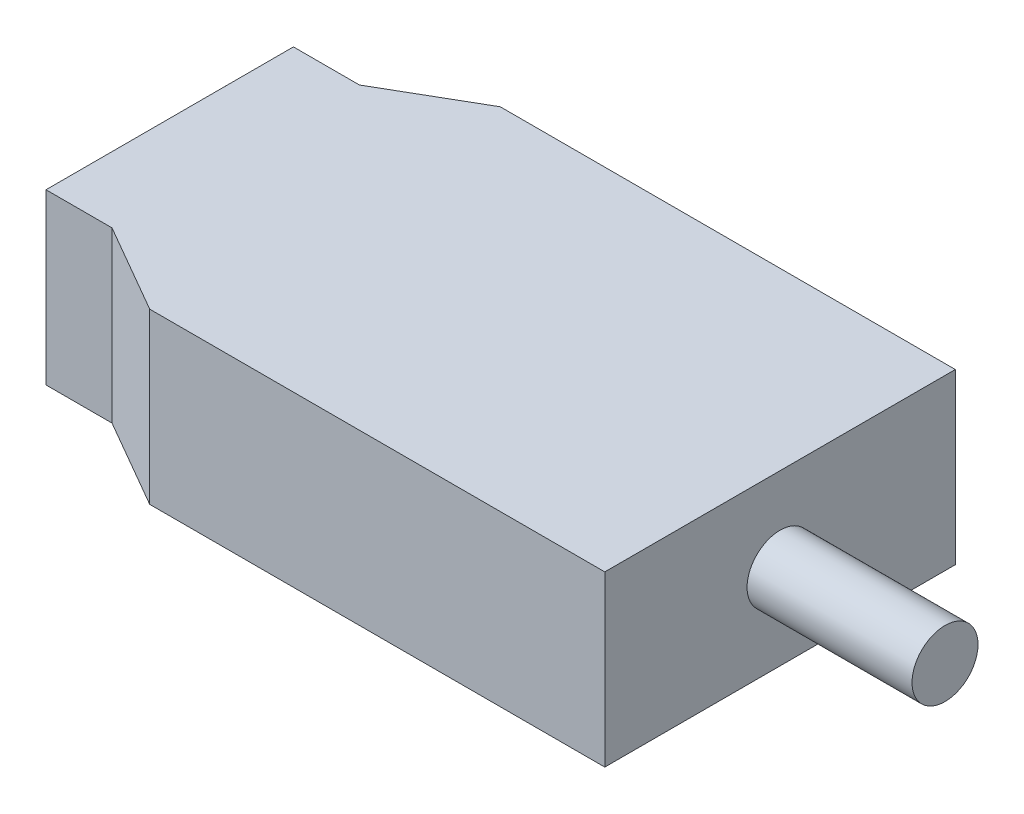
ISO-10303-21;
HEADER;
FILE_DESCRIPTION(('STEP AP214'),'2;1');
FILE_NAME('part.step','',(''),(''),'','','');
FILE_SCHEMA(('AUTOMOTIVE_DESIGN { 1 0 10303 214 1 1 1 1 }'));
ENDSEC;
DATA;
#1=APPLICATION_CONTEXT('core data for automotive mechanical design processes');
#2=APPLICATION_PROTOCOL_DEFINITION('international standard','automotive_design',2000,#1);
#3=PRODUCT_CONTEXT('',#1,'mechanical');
#4=PRODUCT('Part','Part','',(#3));
#5=PRODUCT_RELATED_PRODUCT_CATEGORY('part','',(#4));
#6=PRODUCT_DEFINITION_FORMATION('','',#4);
#7=PRODUCT_DEFINITION_CONTEXT('part definition',#1,'design');
#8=PRODUCT_DEFINITION('design','',#6,#7);
#9=PRODUCT_DEFINITION_SHAPE('','',#8);
#10=(LENGTH_UNIT() NAMED_UNIT(*) SI_UNIT(.MILLI.,.METRE.));
#11=(NAMED_UNIT(*) PLANE_ANGLE_UNIT() SI_UNIT($,.RADIAN.));
#12=(NAMED_UNIT(*) SI_UNIT($,.STERADIAN.) SOLID_ANGLE_UNIT());
#13=UNCERTAINTY_MEASURE_WITH_UNIT(LENGTH_MEASURE(1.E-05),#10,'distance_accuracy_value','');
#14=(GEOMETRIC_REPRESENTATION_CONTEXT(3) GLOBAL_UNCERTAINTY_ASSIGNED_CONTEXT((#13)) GLOBAL_UNIT_ASSIGNED_CONTEXT((#10,
#11,#12)) REPRESENTATION_CONTEXT('',''));
#15=CARTESIAN_POINT('',(0.,0.,0.));
#16=DIRECTION('',(0.,0.,1.));
#17=DIRECTION('',(1.,0.,0.));
#18=AXIS2_PLACEMENT_3D('',#15,#16,#17);
#19=CARTESIAN_POINT('',(0.,-10.25,-21.25));
#20=DIRECTION('',(1.,0.,0.));
#21=DIRECTION('',(0.,0.,-1.));
#22=AXIS2_PLACEMENT_3D('',#19,#20,#21);
#23=PLANE('',#22);
#24=DIRECTION('',(0.,1.,0.));
#25=VECTOR('',#24,1.);
#26=CARTESIAN_POINT('',(0.,-10.25,-21.25));
#27=LINE('',#26,#25);
#28=CARTESIAN_POINT('',(0.,-10.25,-21.25));
#29=VERTEX_POINT('',#28);
#30=CARTESIAN_POINT('',(0.,10.25,-21.25));
#31=VERTEX_POINT('',#30);
#32=EDGE_CURVE('E11',#29,#31,#27,.T.);
#33=ORIENTED_EDGE('',*,*,#32,.T.);
#34=DIRECTION('',(0.,0.,-1.));
#35=VECTOR('',#34,1.);
#36=CARTESIAN_POINT('',(0.,10.25,-21.25));
#37=LINE('',#36,#35);
#38=CARTESIAN_POINT('',(0.,10.25,21.25));
#39=VERTEX_POINT('',#38);
#40=EDGE_CURVE('E117',#39,#31,#37,.T.);
#41=ORIENTED_EDGE('',*,*,#40,.F.);
#42=DIRECTION('',(0.,1.,0.));
#43=VECTOR('',#42,1.);
#44=CARTESIAN_POINT('',(0.,-10.25,21.25));
#45=LINE('',#44,#43);
#46=CARTESIAN_POINT('',(0.,-10.25,21.25));
#47=VERTEX_POINT('',#46);
#48=EDGE_CURVE('E43',#47,#39,#45,.T.);
#49=ORIENTED_EDGE('',*,*,#48,.F.);
#50=DIRECTION('',(0.,0.,-1.));
#51=VECTOR('',#50,1.);
#52=CARTESIAN_POINT('',(0.,-10.25,-21.25));
#53=LINE('',#52,#51);
#54=EDGE_CURVE('E105',#47,#29,#53,.T.);
#55=ORIENTED_EDGE('',*,*,#54,.T.);
#56=EDGE_LOOP('',(#33,#41,#49,#55));
#57=FACE_BOUND('',#56,.T.);
#58=CARTESIAN_POINT('',(0.,0.,0.));
#59=DIRECTION('',(1.,0.,0.));
#60=DIRECTION('',(0.,0.,-1.));
#61=AXIS2_PLACEMENT_3D('',#58,#59,#60);
#62=CIRCLE('',#61,4.);
#63=CARTESIAN_POINT('',(0.,0.,-4.));
#64=VERTEX_POINT('',#63);
#65=EDGE_CURVE('E121',#64,#64,#62,.T.);
#66=ORIENTED_EDGE('',*,*,#65,.F.);
#67=EDGE_LOOP('',(#66));
#68=FACE_BOUND('',#67,.T.);
#69=ADVANCED_FACE('F34',(#57,#68),#23,.T.);
#70=CARTESIAN_POINT('',(-55.1746824526945,-10.25,-21.25));
#71=DIRECTION('',(0.,0.,-1.));
#72=DIRECTION('',(-1.,0.,0.));
#73=AXIS2_PLACEMENT_3D('',#70,#71,#72);
#74=PLANE('',#73);
#75=DIRECTION('',(0.,1.,0.));
#76=VECTOR('',#75,1.);
#77=CARTESIAN_POINT('',(-55.1746824526945,-10.25,-21.25));
#78=LINE('',#77,#76);
#79=CARTESIAN_POINT('',(-55.1746824526945,-10.25,-21.25));
#80=VERTEX_POINT('',#79);
#81=CARTESIAN_POINT('',(-55.1746824526945,10.25,-21.25));
#82=VERTEX_POINT('',#81);
#83=EDGE_CURVE('E38',#80,#82,#78,.T.);
#84=ORIENTED_EDGE('',*,*,#83,.T.);
#85=DIRECTION('',(-1.,0.,0.));
#86=VECTOR('',#85,1.);
#87=CARTESIAN_POINT('',(-55.1746824526945,10.25,-21.25));
#88=LINE('',#87,#86);
#89=EDGE_CURVE('E99',#31,#82,#88,.T.);
#90=ORIENTED_EDGE('',*,*,#89,.F.);
#91=ORIENTED_EDGE('',*,*,#32,.F.);
#92=DIRECTION('',(-1.,0.,0.));
#93=VECTOR('',#92,1.);
#94=CARTESIAN_POINT('',(-55.1746824526945,-10.25,-21.25));
#95=LINE('',#94,#93);
#96=EDGE_CURVE('E100',#29,#80,#95,.T.);
#97=ORIENTED_EDGE('',*,*,#96,.T.);
#98=EDGE_LOOP('',(#84,#90,#91,#97));
#99=FACE_BOUND('',#98,.T.);
#100=ADVANCED_FACE('F36',(#99),#74,.T.);
#101=CARTESIAN_POINT('',(0.,-10.25,21.25));
#102=DIRECTION('',(0.,0.,1.));
#103=DIRECTION('',(1.,0.,0.));
#104=AXIS2_PLACEMENT_3D('',#101,#102,#103);
#105=PLANE('',#104);
#106=ORIENTED_EDGE('',*,*,#48,.T.);
#107=DIRECTION('',(1.,0.,0.));
#108=VECTOR('',#107,1.);
#109=CARTESIAN_POINT('',(0.,10.25,21.25));
#110=LINE('',#109,#108);
#111=CARTESIAN_POINT('',(-55.1746824526945,10.25,21.25));
#112=VERTEX_POINT('',#111);
#113=EDGE_CURVE('E135',#112,#39,#110,.T.);
#114=ORIENTED_EDGE('',*,*,#113,.F.);
#115=DIRECTION('',(0.,1.,0.));
#116=VECTOR('',#115,1.);
#117=CARTESIAN_POINT('',(-55.1746824526945,-10.25,21.25));
#118=LINE('',#117,#116);
#119=CARTESIAN_POINT('',(-55.1746824526945,-10.25,21.25));
#120=VERTEX_POINT('',#119);
#121=EDGE_CURVE('E157',#120,#112,#118,.T.);
#122=ORIENTED_EDGE('',*,*,#121,.F.);
#123=DIRECTION('',(1.,0.,0.));
#124=VECTOR('',#123,1.);
#125=CARTESIAN_POINT('',(0.,-10.25,21.25));
#126=LINE('',#125,#124);
#127=EDGE_CURVE('E153',#120,#47,#126,.T.);
#128=ORIENTED_EDGE('',*,*,#127,.T.);
#129=EDGE_LOOP('',(#106,#114,#122,#128));
#130=FACE_BOUND('',#129,.T.);
#131=ADVANCED_FACE('F185',(#130),#105,.T.);
#132=CARTESIAN_POINT('',(-66.,-10.25,15.));
#133=DIRECTION('',(-0.500000000000001,0.,0.866025403784438));
#134=DIRECTION('',(0.866025403784438,0.,0.500000000000001));
#135=AXIS2_PLACEMENT_3D('',#132,#133,#134);
#136=PLANE('',#135);
#137=ORIENTED_EDGE('',*,*,#121,.T.);
#138=DIRECTION('',(0.866025403784438,0.,0.500000000000001));
#139=VECTOR('',#138,1.);
#140=CARTESIAN_POINT('',(-66.,10.25,15.));
#141=LINE('',#140,#139);
#142=CARTESIAN_POINT('',(-66.,10.25,15.));
#143=VERTEX_POINT('',#142);
#144=EDGE_CURVE('E132',#143,#112,#141,.T.);
#145=ORIENTED_EDGE('',*,*,#144,.F.);
#146=DIRECTION('',(0.,1.,0.));
#147=VECTOR('',#146,1.);
#148=CARTESIAN_POINT('',(-66.,-10.25,15.));
#149=LINE('',#148,#147);
#150=CARTESIAN_POINT('',(-66.,-10.25,15.));
#151=VERTEX_POINT('',#150);
#152=EDGE_CURVE('E159',#151,#143,#149,.T.);
#153=ORIENTED_EDGE('',*,*,#152,.F.);
#154=DIRECTION('',(0.866025403784438,0.,0.500000000000001));
#155=VECTOR('',#154,1.);
#156=CARTESIAN_POINT('',(-66.,-10.25,15.));
#157=LINE('',#156,#155);
#158=EDGE_CURVE('E150',#151,#120,#157,.T.);
#159=ORIENTED_EDGE('',*,*,#158,.T.);
#160=EDGE_LOOP('',(#137,#145,#153,#159));
#161=FACE_BOUND('',#160,.T.);
#162=ADVANCED_FACE('F181',(#161),#136,.T.);
#163=CARTESIAN_POINT('',(-74.,-10.25,15.));
#164=DIRECTION('',(0.,0.,1.));
#165=DIRECTION('',(1.,0.,0.));
#166=AXIS2_PLACEMENT_3D('',#163,#164,#165);
#167=PLANE('',#166);
#168=ORIENTED_EDGE('',*,*,#152,.T.);
#169=DIRECTION('',(1.,0.,0.));
#170=VECTOR('',#169,1.);
#171=CARTESIAN_POINT('',(-74.,10.25,15.));
#172=LINE('',#171,#170);
#173=CARTESIAN_POINT('',(-74.,10.25,15.));
#174=VERTEX_POINT('',#173);
#175=EDGE_CURVE('E129',#174,#143,#172,.T.);
#176=ORIENTED_EDGE('',*,*,#175,.F.);
#177=DIRECTION('',(0.,1.,0.));
#178=VECTOR('',#177,1.);
#179=CARTESIAN_POINT('',(-74.,-10.25,15.));
#180=LINE('',#179,#178);
#181=CARTESIAN_POINT('',(-74.,-10.25,15.));
#182=VERTEX_POINT('',#181);
#183=EDGE_CURVE('E161',#182,#174,#180,.T.);
#184=ORIENTED_EDGE('',*,*,#183,.F.);
#185=DIRECTION('',(1.,0.,0.));
#186=VECTOR('',#185,1.);
#187=CARTESIAN_POINT('',(-74.,-10.25,15.));
#188=LINE('',#187,#186);
#189=EDGE_CURVE('E147',#182,#151,#188,.T.);
#190=ORIENTED_EDGE('',*,*,#189,.T.);
#191=EDGE_LOOP('',(#168,#176,#184,#190));
#192=FACE_BOUND('',#191,.T.);
#193=ADVANCED_FACE('F174',(#192),#167,.T.);
#194=CARTESIAN_POINT('',(-74.,-10.25,15.));
#195=DIRECTION('',(-1.,0.,0.));
#196=DIRECTION('',(0.,0.,1.));
#197=AXIS2_PLACEMENT_3D('',#194,#195,#196);
#198=PLANE('',#197);
#199=ORIENTED_EDGE('',*,*,#183,.T.);
#200=DIRECTION('',(0.,0.,1.));
#201=VECTOR('',#200,1.);
#202=CARTESIAN_POINT('',(-74.,10.25,15.));
#203=LINE('',#202,#201);
#204=CARTESIAN_POINT('',(-74.,10.25,-15.));
#205=VERTEX_POINT('',#204);
#206=EDGE_CURVE('E126',#205,#174,#203,.T.);
#207=ORIENTED_EDGE('',*,*,#206,.F.);
#208=DIRECTION('',(0.,1.,0.));
#209=VECTOR('',#208,1.);
#210=CARTESIAN_POINT('',(-74.,-10.25,-15.));
#211=LINE('',#210,#209);
#212=CARTESIAN_POINT('',(-74.,-10.25,-15.));
#213=VERTEX_POINT('',#212);
#214=EDGE_CURVE('E163',#213,#205,#211,.T.);
#215=ORIENTED_EDGE('',*,*,#214,.F.);
#216=DIRECTION('',(0.,0.,1.));
#217=VECTOR('',#216,1.);
#218=CARTESIAN_POINT('',(-74.,-10.25,15.));
#219=LINE('',#218,#217);
#220=EDGE_CURVE('E144',#213,#182,#219,.T.);
#221=ORIENTED_EDGE('',*,*,#220,.T.);
#222=EDGE_LOOP('',(#199,#207,#215,#221));
#223=FACE_BOUND('',#222,.T.);
#224=ADVANCED_FACE('F171',(#223),#198,.T.);
#225=CARTESIAN_POINT('',(-74.,-10.25,-15.));
#226=DIRECTION('',(0.,0.,-1.));
#227=DIRECTION('',(-1.,0.,0.));
#228=AXIS2_PLACEMENT_3D('',#225,#226,#227);
#229=PLANE('',#228);
#230=ORIENTED_EDGE('',*,*,#214,.T.);
#231=DIRECTION('',(-1.,0.,0.));
#232=VECTOR('',#231,1.);
#233=CARTESIAN_POINT('',(-74.,10.25,-15.));
#234=LINE('',#233,#232);
#235=CARTESIAN_POINT('',(-66.,10.25,-15.));
#236=VERTEX_POINT('',#235);
#237=EDGE_CURVE('E112',#236,#205,#234,.T.);
#238=ORIENTED_EDGE('',*,*,#237,.F.);
#239=DIRECTION('',(0.,1.,0.));
#240=VECTOR('',#239,1.);
#241=CARTESIAN_POINT('',(-66.,-10.25,-15.));
#242=LINE('',#241,#240);
#243=CARTESIAN_POINT('',(-66.,-10.25,-15.));
#244=VERTEX_POINT('',#243);
#245=EDGE_CURVE('E104',#244,#236,#242,.T.);
#246=ORIENTED_EDGE('',*,*,#245,.F.);
#247=DIRECTION('',(-1.,0.,0.));
#248=VECTOR('',#247,1.);
#249=CARTESIAN_POINT('',(-74.,-10.25,-15.));
#250=LINE('',#249,#248);
#251=EDGE_CURVE('E141',#244,#213,#250,.T.);
#252=ORIENTED_EDGE('',*,*,#251,.T.);
#253=EDGE_LOOP('',(#230,#238,#246,#252));
#254=FACE_BOUND('',#253,.T.);
#255=ADVANCED_FACE('F165',(#254),#229,.T.);
#256=CARTESIAN_POINT('',(-66.,-10.25,-15.));
#257=DIRECTION('',(-0.500000000000001,0.,-0.866025403784438));
#258=DIRECTION('',(-0.866025403784438,0.,0.500000000000001));
#259=AXIS2_PLACEMENT_3D('',#256,#257,#258);
#260=PLANE('',#259);
#261=ORIENTED_EDGE('',*,*,#245,.T.);
#262=DIRECTION('',(-0.866025403784438,0.,0.500000000000001));
#263=VECTOR('',#262,1.);
#264=CARTESIAN_POINT('',(-66.,10.25,-15.));
#265=LINE('',#264,#263);
#266=EDGE_CURVE('E107',#82,#236,#265,.T.);
#267=ORIENTED_EDGE('',*,*,#266,.F.);
#268=ORIENTED_EDGE('',*,*,#83,.F.);
#269=DIRECTION('',(-0.866025403784438,0.,0.500000000000001));
#270=VECTOR('',#269,1.);
#271=CARTESIAN_POINT('',(-66.,-10.25,-15.));
#272=LINE('',#271,#270);
#273=EDGE_CURVE('E139',#80,#244,#272,.T.);
#274=ORIENTED_EDGE('',*,*,#273,.T.);
#275=EDGE_LOOP('',(#261,#267,#268,#274));
#276=FACE_BOUND('',#275,.T.);
#277=ADVANCED_FACE('F108',(#276),#260,.T.);
#278=CARTESIAN_POINT('',(0.,-10.25,0.));
#279=DIRECTION('',(0.,-1.,0.));
#280=DIRECTION('',(0.,0.,-1.));
#281=AXIS2_PLACEMENT_3D('',#278,#279,#280);
#282=PLANE('',#281);
#283=ORIENTED_EDGE('',*,*,#96,.F.);
#284=ORIENTED_EDGE('',*,*,#54,.F.);
#285=ORIENTED_EDGE('',*,*,#127,.F.);
#286=ORIENTED_EDGE('',*,*,#158,.F.);
#287=ORIENTED_EDGE('',*,*,#189,.F.);
#288=ORIENTED_EDGE('',*,*,#220,.F.);
#289=ORIENTED_EDGE('',*,*,#251,.F.);
#290=ORIENTED_EDGE('',*,*,#273,.F.);
#291=EDGE_LOOP('',(#283,#284,#285,#286,#287,#288,#289,#290));
#292=FACE_BOUND('',#291,.T.);
#293=ADVANCED_FACE('F177',(#292),#282,.T.);
#294=CARTESIAN_POINT('',(0.,10.25,0.));
#295=DIRECTION('',(0.,-1.,0.));
#296=DIRECTION('',(0.,0.,-1.));
#297=AXIS2_PLACEMENT_3D('',#294,#295,#296);
#298=PLANE('',#297);
#299=ORIENTED_EDGE('',*,*,#89,.T.);
#300=ORIENTED_EDGE('',*,*,#266,.T.);
#301=ORIENTED_EDGE('',*,*,#237,.T.);
#302=ORIENTED_EDGE('',*,*,#206,.T.);
#303=ORIENTED_EDGE('',*,*,#175,.T.);
#304=ORIENTED_EDGE('',*,*,#144,.T.);
#305=ORIENTED_EDGE('',*,*,#113,.T.);
#306=ORIENTED_EDGE('',*,*,#40,.T.);
#307=EDGE_LOOP('',(#299,#300,#301,#302,#303,#304,#305,#306));
#308=FACE_BOUND('',#307,.T.);
#309=ADVANCED_FACE('F115',(#308),#298,.F.);
#310=CARTESIAN_POINT('',(20.,0.,0.));
#311=DIRECTION('',(-1.,0.,0.));
#312=DIRECTION('',(0.,0.,1.));
#313=AXIS2_PLACEMENT_3D('',#310,#311,#312);
#314=CYLINDRICAL_SURFACE('',#313,4.);
#315=CARTESIAN_POINT('',(20.,0.,0.));
#316=DIRECTION('',(1.,0.,0.));
#317=DIRECTION('',(0.,0.,-1.));
#318=AXIS2_PLACEMENT_3D('',#315,#316,#317);
#319=CIRCLE('',#318,4.);
#320=CARTESIAN_POINT('',(20.,0.,-4.));
#321=VERTEX_POINT('',#320);
#322=EDGE_CURVE('E118',#321,#321,#319,.T.);
#323=ORIENTED_EDGE('',*,*,#322,.F.);
#324=EDGE_LOOP('',(#323));
#325=FACE_BOUND('',#324,.T.);
#326=ORIENTED_EDGE('',*,*,#65,.T.);
#327=EDGE_LOOP('',(#326));
#328=FACE_BOUND('',#327,.T.);
#329=ADVANCED_FACE('F192',(#325,#328),#314,.T.);
#330=CARTESIAN_POINT('',(20.,0.,0.));
#331=DIRECTION('',(1.,0.,0.));
#332=DIRECTION('',(0.,0.,-1.));
#333=AXIS2_PLACEMENT_3D('',#330,#331,#332);
#334=PLANE('',#333);
#335=ORIENTED_EDGE('',*,*,#322,.T.);
#336=EDGE_LOOP('',(#335));
#337=FACE_BOUND('',#336,.T.);
#338=ADVANCED_FACE('F194',(#337),#334,.T.);
#339=CLOSED_SHELL('',(#69,#100,#131,#162,#193,#224,#255,#277,#293,#309,#329,#338));
#340=MANIFOLD_SOLID_BREP('B2',#339);
#341=ADVANCED_BREP_SHAPE_REPRESENTATION('',(#18,#340),#14);
#342=SHAPE_DEFINITION_REPRESENTATION(#9,#341);
ENDSEC;
END-ISO-10303-21;
